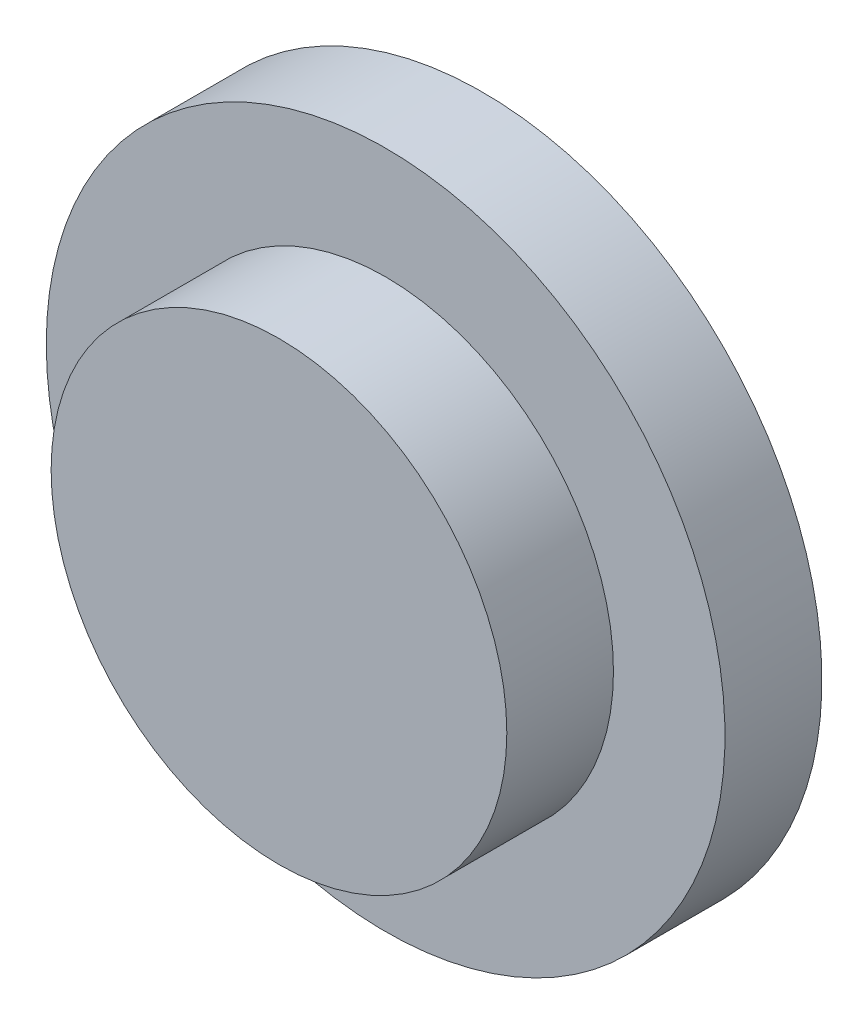
ISO-10303-21;
HEADER;
FILE_DESCRIPTION(('STEP AP214'),'2;1');
FILE_NAME('part.step','',(''),(''),'','','');
FILE_SCHEMA(('AUTOMOTIVE_DESIGN { 1 0 10303 214 1 1 1 1 }'));
ENDSEC;
DATA;
#1=APPLICATION_CONTEXT('core data for automotive mechanical design processes');
#2=APPLICATION_PROTOCOL_DEFINITION('international standard','automotive_design',2000,#1);
#3=PRODUCT_CONTEXT('',#1,'mechanical');
#4=PRODUCT('Part','Part','',(#3));
#5=PRODUCT_RELATED_PRODUCT_CATEGORY('part','',(#4));
#6=PRODUCT_DEFINITION_FORMATION('','',#4);
#7=PRODUCT_DEFINITION_CONTEXT('part definition',#1,'design');
#8=PRODUCT_DEFINITION('design','',#6,#7);
#9=PRODUCT_DEFINITION_SHAPE('','',#8);
#10=(LENGTH_UNIT() NAMED_UNIT(*) SI_UNIT(.MILLI.,.METRE.));
#11=(NAMED_UNIT(*) PLANE_ANGLE_UNIT() SI_UNIT($,.RADIAN.));
#12=(NAMED_UNIT(*) SI_UNIT($,.STERADIAN.) SOLID_ANGLE_UNIT());
#13=UNCERTAINTY_MEASURE_WITH_UNIT(LENGTH_MEASURE(1.E-05),#10,'distance_accuracy_value','');
#14=(GEOMETRIC_REPRESENTATION_CONTEXT(3) GLOBAL_UNCERTAINTY_ASSIGNED_CONTEXT((#13)) GLOBAL_UNIT_ASSIGNED_CONTEXT((#10,
#11,#12)) REPRESENTATION_CONTEXT('',''));
#15=CARTESIAN_POINT('',(0.,0.,0.));
#16=DIRECTION('',(0.,0.,1.));
#17=DIRECTION('',(1.,0.,0.));
#18=AXIS2_PLACEMENT_3D('',#15,#16,#17);
#19=CARTESIAN_POINT('',(0.,0.,2.2));
#20=DIRECTION('',(0.,0.,-1.));
#21=DIRECTION('',(-1.,0.,0.));
#22=AXIS2_PLACEMENT_3D('',#19,#20,#21);
#23=CYLINDRICAL_SURFACE('',#22,4.7);
#24=CARTESIAN_POINT('',(0.,0.,2.2));
#25=DIRECTION('',(0.,0.,1.));
#26=DIRECTION('',(1.,0.,0.));
#27=AXIS2_PLACEMENT_3D('',#24,#25,#26);
#28=CIRCLE('',#27,4.7);
#29=CARTESIAN_POINT('',(4.7,0.,2.2));
#30=VERTEX_POINT('',#29);
#31=EDGE_CURVE('E10',#30,#30,#28,.T.);
#32=ORIENTED_EDGE('',*,*,#31,.F.);
#33=EDGE_LOOP('',(#32));
#34=FACE_BOUND('',#33,.T.);
#35=CARTESIAN_POINT('',(0.,0.,0.));
#36=DIRECTION('',(0.,0.,-1.));
#37=DIRECTION('',(-1.,0.,0.));
#38=AXIS2_PLACEMENT_3D('',#35,#36,#37);
#39=CIRCLE('',#38,4.7);
#40=CARTESIAN_POINT('',(-4.7,0.,0.));
#41=VERTEX_POINT('',#40);
#42=EDGE_CURVE('E39',#41,#41,#39,.T.);
#43=ORIENTED_EDGE('',*,*,#42,.F.);
#44=EDGE_LOOP('',(#43));
#45=FACE_BOUND('',#44,.T.);
#46=ADVANCED_FACE('F33',(#34,#45),#23,.T.);
#47=CARTESIAN_POINT('',(0.,0.,2.2));
#48=DIRECTION('',(0.,0.,1.));
#49=DIRECTION('',(1.,0.,0.));
#50=AXIS2_PLACEMENT_3D('',#47,#48,#49);
#51=PLANE('',#50);
#52=ORIENTED_EDGE('',*,*,#31,.T.);
#53=EDGE_LOOP('',(#52));
#54=FACE_BOUND('',#53,.T.);
#55=ADVANCED_FACE('F57',(#54),#51,.T.);
#56=CARTESIAN_POINT('',(0.,0.,0.));
#57=DIRECTION('',(0.,0.,-1.));
#58=DIRECTION('',(-1.,0.,0.));
#59=AXIS2_PLACEMENT_3D('',#56,#57,#58);
#60=PLANE('',#59);
#61=CARTESIAN_POINT('',(0.,0.,0.));
#62=DIRECTION('',(0.,0.,-1.));
#63=DIRECTION('',(-1.,0.,0.));
#64=AXIS2_PLACEMENT_3D('',#61,#62,#63);
#65=CIRCLE('',#64,7.);
#66=CARTESIAN_POINT('',(-7.,0.,0.));
#67=VERTEX_POINT('',#66);
#68=EDGE_CURVE('E47',#67,#67,#65,.T.);
#69=ORIENTED_EDGE('',*,*,#68,.F.);
#70=EDGE_LOOP('',(#69));
#71=FACE_BOUND('',#70,.T.);
#72=ORIENTED_EDGE('',*,*,#42,.T.);
#73=EDGE_LOOP('',(#72));
#74=FACE_BOUND('',#73,.T.);
#75=ADVANCED_FACE('F55',(#71,#74),#60,.F.);
#76=CARTESIAN_POINT('',(0.,0.,-2.));
#77=DIRECTION('',(0.,0.,1.));
#78=DIRECTION('',(1.,0.,0.));
#79=AXIS2_PLACEMENT_3D('',#76,#77,#78);
#80=CYLINDRICAL_SURFACE('',#79,7.);
#81=CARTESIAN_POINT('',(0.,0.,-2.));
#82=DIRECTION('',(0.,0.,-1.));
#83=DIRECTION('',(-1.,0.,0.));
#84=AXIS2_PLACEMENT_3D('',#81,#82,#83);
#85=CIRCLE('',#84,7.);
#86=CARTESIAN_POINT('',(-7.,0.,-2.));
#87=VERTEX_POINT('',#86);
#88=EDGE_CURVE('E43',#87,#87,#85,.T.);
#89=ORIENTED_EDGE('',*,*,#88,.F.);
#90=EDGE_LOOP('',(#89));
#91=FACE_BOUND('',#90,.T.);
#92=ORIENTED_EDGE('',*,*,#68,.T.);
#93=EDGE_LOOP('',(#92));
#94=FACE_BOUND('',#93,.T.);
#95=ADVANCED_FACE('F53',(#91,#94),#80,.T.);
#96=CARTESIAN_POINT('',(0.,0.,-2.));
#97=DIRECTION('',(0.,0.,-1.));
#98=DIRECTION('',(-1.,0.,0.));
#99=AXIS2_PLACEMENT_3D('',#96,#97,#98);
#100=PLANE('',#99);
#101=ORIENTED_EDGE('',*,*,#88,.T.);
#102=EDGE_LOOP('',(#101));
#103=FACE_BOUND('',#102,.T.);
#104=ADVANCED_FACE('F63',(#103),#100,.T.);
#105=CLOSED_SHELL('',(#46,#55,#75,#95,#104));
#106=MANIFOLD_SOLID_BREP('B2',#105);
#107=ADVANCED_BREP_SHAPE_REPRESENTATION('',(#18,#106),#14);
#108=SHAPE_DEFINITION_REPRESENTATION(#9,#107);
ENDSEC;
END-ISO-10303-21;
